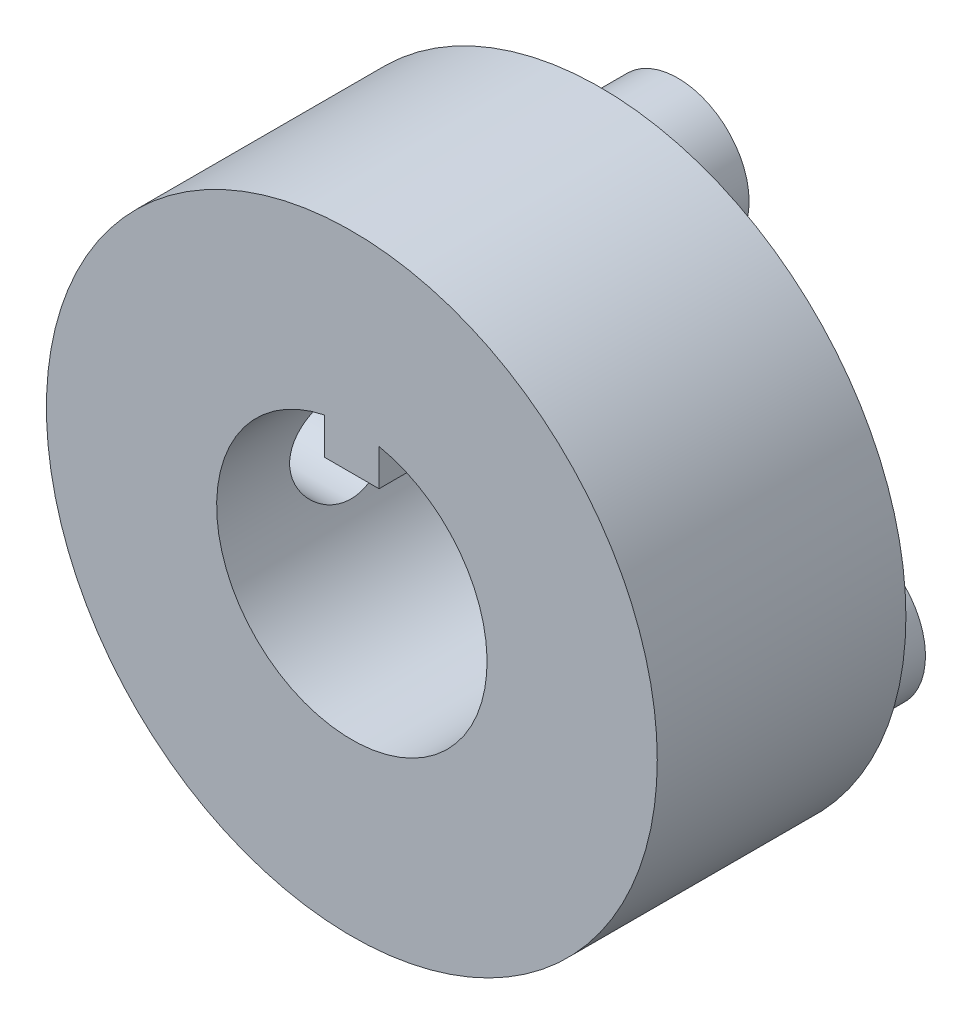
ISO-10303-21;
HEADER;
FILE_DESCRIPTION(('STEP AP214'),'2;1');
FILE_NAME('part.step','',(''),(''),'','','');
FILE_SCHEMA(('AUTOMOTIVE_DESIGN { 1 0 10303 214 1 1 1 1 }'));
ENDSEC;
DATA;
#1=APPLICATION_CONTEXT('core data for automotive mechanical design processes');
#2=APPLICATION_PROTOCOL_DEFINITION('international standard','automotive_design',2000,#1);
#3=PRODUCT_CONTEXT('',#1,'mechanical');
#4=PRODUCT('Part','Part','',(#3));
#5=PRODUCT_RELATED_PRODUCT_CATEGORY('part','',(#4));
#6=PRODUCT_DEFINITION_FORMATION('','',#4);
#7=PRODUCT_DEFINITION_CONTEXT('part definition',#1,'design');
#8=PRODUCT_DEFINITION('design','',#6,#7);
#9=PRODUCT_DEFINITION_SHAPE('','',#8);
#10=(LENGTH_UNIT() NAMED_UNIT(*) SI_UNIT(.MILLI.,.METRE.));
#11=(NAMED_UNIT(*) PLANE_ANGLE_UNIT() SI_UNIT($,.RADIAN.));
#12=(NAMED_UNIT(*) SI_UNIT($,.STERADIAN.) SOLID_ANGLE_UNIT());
#13=UNCERTAINTY_MEASURE_WITH_UNIT(LENGTH_MEASURE(1.E-05),#10,'distance_accuracy_value','');
#14=(GEOMETRIC_REPRESENTATION_CONTEXT(3) GLOBAL_UNCERTAINTY_ASSIGNED_CONTEXT((#13)) GLOBAL_UNIT_ASSIGNED_CONTEXT((#10,
#11,#12)) REPRESENTATION_CONTEXT('',''));
#15=CARTESIAN_POINT('',(0.,0.,0.));
#16=DIRECTION('',(0.,0.,1.));
#17=DIRECTION('',(1.,0.,0.));
#18=AXIS2_PLACEMENT_3D('',#15,#16,#17);
#19=CARTESIAN_POINT('',(0.,0.,0.));
#20=DIRECTION('',(0.,0.,1.));
#21=DIRECTION('',(1.,0.,0.));
#22=AXIS2_PLACEMENT_3D('',#19,#20,#21);
#23=PLANE('',#22);
#24=CARTESIAN_POINT('',(0.,0.,0.));
#25=DIRECTION('',(0.,0.,1.));
#26=DIRECTION('',(1.,0.,0.));
#27=AXIS2_PLACEMENT_3D('',#24,#25,#26);
#28=CIRCLE('',#27,15.);
#29=CARTESIAN_POINT('',(15.,0.,0.));
#30=VERTEX_POINT('',#29);
#31=EDGE_CURVE('E169',#30,#30,#28,.T.);
#32=ORIENTED_EDGE('',*,*,#31,.F.);
#33=EDGE_LOOP('',(#32));
#34=FACE_BOUND('',#33,.T.);
#35=CARTESIAN_POINT('',(0.,10.,0.));
#36=DIRECTION('',(0.,0.,1.));
#37=DIRECTION('',(1.,0.,0.));
#38=AXIS2_PLACEMENT_3D('',#35,#36,#37);
#39=CIRCLE('',#38,3.5);
#40=CARTESIAN_POINT('',(3.5,10.,0.));
#41=VERTEX_POINT('',#40);
#42=EDGE_CURVE('E11',#41,#41,#39,.F.);
#43=ORIENTED_EDGE('',*,*,#42,.F.);
#44=EDGE_LOOP('',(#43));
#45=FACE_BOUND('',#44,.T.);
#46=CARTESIAN_POINT('',(8.66025403784439,-5.,0.));
#47=DIRECTION('',(0.,0.,-1.));
#48=DIRECTION('',(-1.,0.,0.));
#49=AXIS2_PLACEMENT_3D('',#46,#47,#48);
#50=CIRCLE('',#49,3.5);
#51=CARTESIAN_POINT('',(6.10738194841974,-2.605664164108,0.));
#52=VERTEX_POINT('',#51);
#53=CARTESIAN_POINT('',(5.31026233405814,-3.986315835892,0.));
#54=VERTEX_POINT('',#53);
#55=EDGE_CURVE('E121',#52,#54,#50,.T.);
#56=ORIENTED_EDGE('',*,*,#55,.F.);
#57=CARTESIAN_POINT('',(0.,0.,0.));
#58=DIRECTION('',(0.,0.,1.));
#59=DIRECTION('',(1.,0.,0.));
#60=AXIS2_PLACEMENT_3D('',#57,#58,#59);
#61=CIRCLE('',#60,6.64);
#62=CARTESIAN_POINT('',(1.335,6.50441196419784,0.));
#63=VERTEX_POINT('',#62);
#64=EDGE_CURVE('E125',#52,#63,#61,.T.);
#65=ORIENTED_EDGE('',*,*,#64,.T.);
#66=DIRECTION('',(0.,-1.,0.));
#67=VECTOR('',#66,1.);
#68=CARTESIAN_POINT('',(1.335,6.50441196419784,0.));
#69=LINE('',#68,#67);
#70=CARTESIAN_POINT('',(1.335,4.70441196419784,0.));
#71=VERTEX_POINT('',#70);
#72=EDGE_CURVE('E148',#63,#71,#69,.T.);
#73=ORIENTED_EDGE('',*,*,#72,.T.);
#74=DIRECTION('',(-1.,0.,0.));
#75=VECTOR('',#74,1.);
#76=CARTESIAN_POINT('',(-1.335,4.70441196419784,0.));
#77=LINE('',#76,#75);
#78=CARTESIAN_POINT('',(-1.335,4.70441196419784,0.));
#79=VERTEX_POINT('',#78);
#80=EDGE_CURVE('E151',#71,#79,#77,.T.);
#81=ORIENTED_EDGE('',*,*,#80,.T.);
#82=DIRECTION('',(0.,1.,0.));
#83=VECTOR('',#82,1.);
#84=CARTESIAN_POINT('',(-1.335,6.50441196419784,0.));
#85=LINE('',#84,#83);
#86=CARTESIAN_POINT('',(-1.335,6.50441196419784,0.));
#87=VERTEX_POINT('',#86);
#88=EDGE_CURVE('E154',#79,#87,#85,.T.);
#89=ORIENTED_EDGE('',*,*,#88,.T.);
#90=CARTESIAN_POINT('',(-6.10738194841975,-2.605664164108,0.));
#91=VERTEX_POINT('',#90);
#92=EDGE_CURVE('E63',#87,#91,#61,.T.);
#93=ORIENTED_EDGE('',*,*,#92,.T.);
#94=CARTESIAN_POINT('',(-8.66025403784439,-5.,0.));
#95=DIRECTION('',(0.,0.,-1.));
#96=DIRECTION('',(-1.,0.,0.));
#97=AXIS2_PLACEMENT_3D('',#94,#95,#96);
#98=CIRCLE('',#97,3.5);
#99=CARTESIAN_POINT('',(-5.31026233405814,-3.986315835892,0.));
#100=VERTEX_POINT('',#99);
#101=EDGE_CURVE('E126',#100,#91,#98,.T.);
#102=ORIENTED_EDGE('',*,*,#101,.F.);
#103=EDGE_CURVE('E57',#100,#54,#61,.T.);
#104=ORIENTED_EDGE('',*,*,#103,.T.);
#105=EDGE_LOOP('',(#56,#65,#73,#81,#89,#93,#102,#104));
#106=FACE_BOUND('',#105,.T.);
#107=ADVANCED_FACE('F36',(#34,#45,#106),#23,.F.);
#108=CARTESIAN_POINT('',(0.,0.,12.21));
#109=DIRECTION('',(0.,0.,-1.));
#110=DIRECTION('',(-1.,0.,0.));
#111=AXIS2_PLACEMENT_3D('',#108,#109,#110);
#112=CYLINDRICAL_SURFACE('',#111,15.);
#113=CARTESIAN_POINT('',(-15.,0.,3.585));
#114=CARTESIAN_POINT('',(-14.9999975820402,0.140489449129902,3.58500561833362));
#115=CARTESIAN_POINT('',(-14.9980057235411,0.281055158639661,3.596788071638));
#116=CARTESIAN_POINT('',(-14.9902516226793,0.55824301697478,3.64358632645689));
#117=CARTESIAN_POINT('',(-14.9844859305538,0.694861438051567,3.67862338604372));
#118=CARTESIAN_POINT('',(-14.9698307561421,0.960104373013094,3.77084217064007));
#119=CARTESIAN_POINT('',(-14.9609438459442,1.08873536666226,3.82800566596403));
#120=CARTESIAN_POINT('',(-14.9410229706585,1.33456413906579,3.96280668191572));
#121=CARTESIAN_POINT('',(-14.9299892467727,1.45176320001943,4.04044190282042));
#122=CARTESIAN_POINT('',(-14.9068778267654,1.67255504412655,4.21478415064567));
#123=CARTESIAN_POINT('',(-14.8947918928735,1.77602075895102,4.3116510254663));
#124=CARTESIAN_POINT('',(-14.8710011481769,1.9653111769521,4.52136284107237));
#125=CARTESIAN_POINT('',(-14.8592963616635,2.05113475760514,4.63420879779461));
#126=CARTESIAN_POINT('',(-14.8375133644812,2.20321508602821,4.87354988110309));
#127=CARTESIAN_POINT('',(-14.8274457964338,2.26934596387795,5.00012604019429));
#128=CARTESIAN_POINT('',(-14.8101915074548,2.37935870184779,5.26278769275052));
#129=CARTESIAN_POINT('',(-14.8030045887206,2.42324208966741,5.3988725325393));
#130=CARTESIAN_POINT('',(-14.7924073748742,2.48711335537512,5.67534087574296));
#131=CARTESIAN_POINT('',(-14.7889624089038,2.50732074212323,5.81567231283677));
#132=CARTESIAN_POINT('',(-14.7861342891879,2.52394702595431,6.09777306098804));
#133=CARTESIAN_POINT('',(-14.7867508433751,2.5203676335643,6.23954226792224));
#134=CARTESIAN_POINT('',(-14.7919444520337,2.48970071316855,6.51892586463157));
#135=CARTESIAN_POINT('',(-14.7964799308277,2.46285995493418,6.656568226893));
#136=CARTESIAN_POINT('',(-14.8089352598191,2.38681956251066,6.92536784239926));
#137=CARTESIAN_POINT('',(-14.8168552277908,2.33761915024175,7.05652486978881));
#138=CARTESIAN_POINT('',(-14.8352319767055,2.21800641835068,7.30936848449366));
#139=CARTESIAN_POINT('',(-14.8457009436212,2.14749179899531,7.43100575477524));
#140=CARTESIAN_POINT('',(-14.8679876648032,1.98732491894457,7.66081497344489));
#141=CARTESIAN_POINT('',(-14.8798055296028,1.89767108939388,7.76898581682844));
#142=CARTESIAN_POINT('',(-14.9036410584866,1.70042706131254,7.97021986696351));
#143=CARTESIAN_POINT('',(-14.9156593643327,1.59262517722916,8.06307563444123));
#144=CARTESIAN_POINT('',(-14.9384040736532,1.36286061150674,8.22941181227365));
#145=CARTESIAN_POINT('',(-14.9491304685534,1.24089783589427,8.30289209403963));
#146=CARTESIAN_POINT('',(-14.9680983814198,0.986077223711798,8.42841104718477));
#147=CARTESIAN_POINT('',(-14.9763377512155,0.85321009375028,8.48043119649113));
#148=CARTESIAN_POINT('',(-14.9893860509763,0.580455493804954,8.56135967064502));
#149=CARTESIAN_POINT('',(-14.994195272579,0.440568621735489,8.5902699603614));
#150=CARTESIAN_POINT('',(-14.9998021394395,0.15953314780428,8.62387639269173));
#151=CARTESIAN_POINT('',(-15.0006469547058,0.018419503485328,8.62885727354189));
#152=CARTESIAN_POINT('',(-14.9983590828652,-0.262625887269974,8.61522290482472));
#153=CARTESIAN_POINT('',(-14.9952265513444,-0.402557679722594,8.59660857825747));
#154=CARTESIAN_POINT('',(-14.9853651785459,-0.676386280922814,8.5365490105393));
#155=CARTESIAN_POINT('',(-14.9786585798325,-0.810314920295131,8.49524492656208));
#156=CARTESIAN_POINT('',(-14.962398055966,-1.06934662832967,8.39112893177709));
#157=CARTESIAN_POINT('',(-14.9528439687972,-1.19444919430735,8.32831579712296));
#158=CARTESIAN_POINT('',(-14.9318313003863,-1.43351304524778,8.18231392836192));
#159=CARTESIAN_POINT('',(-14.9203564123948,-1.54736438754156,8.09894756611516));
#160=CARTESIAN_POINT('',(-14.8968237295547,-1.75956294657828,7.91444981087016));
#161=CARTESIAN_POINT('',(-14.8847658916907,-1.85790901690958,7.8133171054514));
#162=CARTESIAN_POINT('',(-14.8612735379745,-2.03736242488147,7.59487965788286));
#163=CARTESIAN_POINT('',(-14.8498469260686,-2.11827725953654,7.47741578374905));
#164=CARTESIAN_POINT('',(-14.8290590893405,-2.25922633810644,7.23039570889064));
#165=CARTESIAN_POINT('',(-14.8196977982932,-2.3192612515785,7.1008398960877));
#166=CARTESIAN_POINT('',(-14.8041599960693,-2.41645931453349,6.83384879847331));
#167=CARTESIAN_POINT('',(-14.7979702247869,-2.45371782043871,6.69644903478755));
#168=CARTESIAN_POINT('',(-14.7894432008793,-2.50460516510729,6.41722854692862));
#169=CARTESIAN_POINT('',(-14.7871056074096,-2.51823609446696,6.27540821502311));
#170=CARTESIAN_POINT('',(-14.7865624597904,-2.52142233821621,5.99329497799041));
#171=CARTESIAN_POINT('',(-14.7883048943293,-2.5112806984035,5.85300550369673));
#172=CARTESIAN_POINT('',(-14.795611402961,-2.46786546894644,5.57615940220628));
#173=CARTESIAN_POINT('',(-14.8011754640901,-2.43459195776879,5.43960276234882));
#174=CARTESIAN_POINT('',(-14.8154783999656,-2.34597432026304,5.17421865001475));
#175=CARTESIAN_POINT('',(-14.824213461393,-2.29065669553287,5.04538210955565));
#176=CARTESIAN_POINT('',(-14.8438778074605,-2.15955234300938,4.79876930831019));
#177=CARTESIAN_POINT('',(-14.8548072037857,-2.0837645732788,4.68099361093583));
#178=CARTESIAN_POINT('',(-14.877793434422,-1.91279142634958,4.45831542937924));
#179=CARTESIAN_POINT('',(-14.8898622707228,-1.81738324467583,4.35358522943975));
#180=CARTESIAN_POINT('',(-14.9136721670648,-1.61034705470809,4.16151761434907));
#181=CARTESIAN_POINT('',(-14.925413150854,-1.49871530997979,4.0741842168541));
#182=CARTESIAN_POINT('',(-14.9473401498941,-1.26146779080068,3.91882748561642));
#183=CARTESIAN_POINT('',(-14.9575146564198,-1.13575924688084,3.85094418244926));
#184=CARTESIAN_POINT('',(-14.9750503001442,-0.874602726333489,3.7373629677436));
#185=CARTESIAN_POINT('',(-14.9824142281429,-0.739164570513421,3.69164303654751));
#186=CARTESIAN_POINT('',(-14.9918983993726,-0.5026729914656,3.63357128054791));
#187=CARTESIAN_POINT('',(-14.9949202053315,-0.403047469656695,3.61538633869243));
#188=CARTESIAN_POINT('',(-14.9989718586461,-0.202294462457671,3.59109878222106));
#189=CARTESIAN_POINT('',(-15.0000017411823,-0.101167003625921,3.58499595421592));
#190=CARTESIAN_POINT('',(-15.,0.,3.585));
#191=B_SPLINE_CURVE_WITH_KNOTS('',3,(#113,#114,#115,#116,#117,#118,#119,#120,#121,#122,#123,
#124,#125,#126,#127,#128,#129,#130,#131,#132,#133,#134,#135,#136,#137,#138,#139,#140,#141,#142,
#143,#144,#145,#146,#147,#148,#149,#150,#151,#152,#153,#154,#155,#156,#157,#158,#159,#160,#161,
#162,#163,#164,#165,#166,#167,#168,#169,#170,#171,#172,#173,#174,#175,#176,#177,#178,#179,#180,
#181,#182,#183,#184,#185,#186,#187,#188,#189,#190),.UNSPECIFIED.,.T.,.F.,(4,2,2,2,2,2,2,2,2,2,2,
2,2,2,2,2,2,2,2,2,2,2,2,2,2,2,2,2,2,2,2,2,2,2,2,2,2,2,4),(0.,0.421098541802472,
0.842582559724108,1.26372005899792,1.68481026927768,2.10955919785378,2.53433514375074,
2.96177056420231,3.38917662937104,3.81258788817943,4.2359686994623,4.65491227546914,
5.07387043115051,5.4948722398034,5.91590857154812,6.34224783261434,6.76858992308264,
7.19529922008233,7.62197223313093,8.0435554340658,8.46512214396861,8.88409543234839,
9.30309256390771,9.72584620629777,10.1486310911353,10.5758695303914,11.0030942681128,
11.4285178995912,11.8539038871548,12.2738967222969,12.6938881327688,13.1133761423611,
13.5328855080593,13.9574515822421,14.3821155932715,14.8097642630611,15.236987181953,
15.5402272501239,15.8434619625472),.UNSPECIFIED.);
#192=CARTESIAN_POINT('',(-15.,0.,3.585));
#193=VERTEX_POINT('',#192);
#194=EDGE_CURVE('E185',#193,#193,#191,.T.);
#195=ORIENTED_EDGE('',*,*,#194,.T.);
#196=EDGE_LOOP('',(#195));
#197=FACE_BOUND('',#196,.T.);
#198=CARTESIAN_POINT('',(0.,0.,12.21));
#199=DIRECTION('',(0.,0.,1.));
#200=DIRECTION('',(1.,0.,0.));
#201=AXIS2_PLACEMENT_3D('',#198,#199,#200);
#202=CIRCLE('',#201,15.);
#203=CARTESIAN_POINT('',(15.,0.,12.21));
#204=VERTEX_POINT('',#203);
#205=EDGE_CURVE('E50',#204,#204,#202,.T.);
#206=ORIENTED_EDGE('',*,*,#205,.F.);
#207=EDGE_LOOP('',(#206));
#208=FACE_BOUND('',#207,.T.);
#209=ORIENTED_EDGE('',*,*,#31,.T.);
#210=EDGE_LOOP('',(#209));
#211=FACE_BOUND('',#210,.T.);
#212=ADVANCED_FACE('F38',(#197,#208,#211),#112,.T.);
#213=CARTESIAN_POINT('',(0.,0.,12.21));
#214=DIRECTION('',(0.,0.,1.));
#215=DIRECTION('',(1.,0.,0.));
#216=AXIS2_PLACEMENT_3D('',#213,#214,#215);
#217=PLANE('',#216);
#218=CARTESIAN_POINT('',(0.,0.,12.21));
#219=DIRECTION('',(0.,0.,1.));
#220=DIRECTION('',(1.,0.,0.));
#221=AXIS2_PLACEMENT_3D('',#218,#219,#220);
#222=CIRCLE('',#221,6.64);
#223=CARTESIAN_POINT('',(-1.335,6.50441196419784,12.21));
#224=VERTEX_POINT('',#223);
#225=CARTESIAN_POINT('',(1.335,6.50441196419784,12.21));
#226=VERTEX_POINT('',#225);
#227=EDGE_CURVE('E146',#224,#226,#222,.T.);
#228=ORIENTED_EDGE('',*,*,#227,.F.);
#229=DIRECTION('',(0.,1.,0.));
#230=VECTOR('',#229,1.);
#231=CARTESIAN_POINT('',(-1.335,6.50441196419784,12.21));
#232=LINE('',#231,#230);
#233=CARTESIAN_POINT('',(-1.335,4.70441196419784,12.21));
#234=VERTEX_POINT('',#233);
#235=EDGE_CURVE('E164',#234,#224,#232,.T.);
#236=ORIENTED_EDGE('',*,*,#235,.F.);
#237=DIRECTION('',(-1.,0.,0.));
#238=VECTOR('',#237,1.);
#239=CARTESIAN_POINT('',(-1.335,4.70441196419784,12.21));
#240=LINE('',#239,#238);
#241=CARTESIAN_POINT('',(1.335,4.70441196419784,12.21));
#242=VERTEX_POINT('',#241);
#243=EDGE_CURVE('E161',#242,#234,#240,.T.);
#244=ORIENTED_EDGE('',*,*,#243,.F.);
#245=DIRECTION('',(0.,-1.,0.));
#246=VECTOR('',#245,1.);
#247=CARTESIAN_POINT('',(1.335,6.50441196419784,12.21));
#248=LINE('',#247,#246);
#249=EDGE_CURVE('E158',#226,#242,#248,.T.);
#250=ORIENTED_EDGE('',*,*,#249,.F.);
#251=EDGE_LOOP('',(#228,#236,#244,#250));
#252=FACE_BOUND('',#251,.T.);
#253=ORIENTED_EDGE('',*,*,#205,.T.);
#254=EDGE_LOOP('',(#253));
#255=FACE_BOUND('',#254,.T.);
#256=ADVANCED_FACE('F230',(#252,#255),#217,.T.);
#257=CARTESIAN_POINT('',(0.,0.,0.));
#258=DIRECTION('',(0.,0.,1.));
#259=DIRECTION('',(1.,0.,0.));
#260=AXIS2_PLACEMENT_3D('',#257,#258,#259);
#261=CYLINDRICAL_SURFACE('',#260,6.64);
#262=CARTESIAN_POINT('',(-6.64,0.,3.585));
#263=CARTESIAN_POINT('',(-6.64000411584716,-0.136357755125959,3.58499455309879));
#264=CARTESIAN_POINT('',(-6.63576339590568,-0.272678678757785,3.59610191612086));
#265=CARTESIAN_POINT('',(-6.61927097472318,-0.541240136044643,3.64005287463028));
#266=CARTESIAN_POINT('',(-6.60702063952025,-0.673481361464684,3.67289276365175));
#267=CARTESIAN_POINT('',(-6.57582201798928,-0.929970988338998,3.75897574133022));
#268=CARTESIAN_POINT('',(-6.55688684891109,-1.05423448366339,3.81217888946313));
#269=CARTESIAN_POINT('',(-6.51419935477894,-1.29206163337442,3.93727242931435));
#270=CARTESIAN_POINT('',(-6.49044570570496,-1.40562233426289,4.00916795885055));
#271=CARTESIAN_POINT('',(-6.43941764179323,-1.62374277556832,4.17285805764356));
#272=CARTESIAN_POINT('',(-6.41204192939597,-1.72777749824901,4.26532033940538));
#273=CARTESIAN_POINT('',(-6.3573473984877,-1.91928929666345,4.46610181919315));
#274=CARTESIAN_POINT('',(-6.33002860071342,-2.00676112427345,4.57442602401666));
#275=CARTESIAN_POINT('',(-6.27735470880237,-2.16604341852793,4.80903347240452));
#276=CARTESIAN_POINT('',(-6.25211861491086,-2.23710530629482,4.9358543561982));
#277=CARTESIAN_POINT('',(-6.208047818367,-2.35665703538024,5.20075528840581));
#278=CARTESIAN_POINT('',(-6.18921048911562,-2.40515614141839,5.33883068807601));
#279=CARTESIAN_POINT('',(-6.16115511869846,-2.47612142324354,5.61627207613328));
#280=CARTESIAN_POINT('',(-6.15156780814298,-2.49959129953904,5.75534271310348));
#281=CARTESIAN_POINT('',(-6.14201915060118,-2.52296976767562,6.03575354874365));
#282=CARTESIAN_POINT('',(-6.1420537034227,-2.52288839547701,6.17709275502662));
#283=CARTESIAN_POINT('',(-6.15142708614572,-2.49993291210435,6.4487662556688));
#284=CARTESIAN_POINT('',(-6.16019324036794,-2.47846167531625,6.57924254420817));
#285=CARTESIAN_POINT('',(-6.18508869858688,-2.41565866348566,6.8345789173816));
#286=CARTESIAN_POINT('',(-6.20121913907468,-2.37432382294721,6.95943813189417));
#287=CARTESIAN_POINT('',(-6.23936360330196,-2.27221267259243,7.20281830054505));
#288=CARTESIAN_POINT('',(-6.26148465893778,-2.21107827871382,7.32117150359388));
#289=CARTESIAN_POINT('',(-6.30908334057454,-2.07135329252578,7.5463423433537));
#290=CARTESIAN_POINT('',(-6.33456214374711,-1.99275657154979,7.65315591044605));
#291=CARTESIAN_POINT('',(-6.3881485418272,-1.81395712419897,7.85996581401401));
#292=CARTESIAN_POINT('',(-6.41631624588967,-1.7126381115178,7.95898388126023));
#293=CARTESIAN_POINT('',(-6.47059893522083,-1.49451282205522,8.13891823811803));
#294=CARTESIAN_POINT('',(-6.49671358908775,-1.37770405307202,8.21983160915926));
#295=CARTESIAN_POINT('',(-6.5444895777279,-1.12937060086937,8.36237396409063));
#296=CARTESIAN_POINT('',(-6.56607201364147,-0.99763837824563,8.42366971292678));
#297=CARTESIAN_POINT('',(-6.60176464335614,-0.724708223765741,8.52290312021829));
#298=CARTESIAN_POINT('',(-6.61587823937631,-0.583514634847382,8.56085141523002));
#299=CARTESIAN_POINT('',(-6.6344410176147,-0.303897173988625,8.61041479701922));
#300=CARTESIAN_POINT('',(-6.63937294691418,-0.1657385707628,8.62334674835339));
#301=CARTESIAN_POINT('',(-6.64051360870022,0.110847069909799,8.6263543268913));
#302=CARTESIAN_POINT('',(-6.63672433126645,0.249274038916533,8.61643516845655));
#303=CARTESIAN_POINT('',(-6.62116648244824,0.516727416107683,8.57501747992149));
#304=CARTESIAN_POINT('',(-6.60971944590668,0.64590908368897,8.5443880013157));
#305=CARTESIAN_POINT('',(-6.58032233648794,0.897203933514361,8.46357012877743));
#306=CARTESIAN_POINT('',(-6.56237141870938,1.01931619499985,8.41337919360557));
#307=CARTESIAN_POINT('',(-6.52107241090368,1.2570648462155,8.29325340695158));
#308=CARTESIAN_POINT('',(-6.49758011694014,1.37240200502256,8.22277743163937));
#309=CARTESIAN_POINT('',(-6.44778794209088,1.59000340814238,8.06469165816309));
#310=CARTESIAN_POINT('',(-6.42148700899178,1.69226272129032,7.97707542836813));
#311=CARTESIAN_POINT('',(-6.3670279462564,1.88716743385005,7.78107096626575));
#312=CARTESIAN_POINT('',(-6.33885235498527,1.97887998654975,7.67175755574685));
#313=CARTESIAN_POINT('',(-6.28531998306322,2.14285178362287,7.43874709251645));
#314=CARTESIAN_POINT('',(-6.2599634894158,2.21510904837709,7.31504857792063));
#315=CARTESIAN_POINT('',(-6.21502296420474,2.33825381082786,7.0556196221519));
#316=CARTESIAN_POINT('',(-6.19546866879011,2.38903177368382,6.9198316842764));
#317=CARTESIAN_POINT('',(-6.16497961929026,2.46665747434898,6.64068005709035));
#318=CARTESIAN_POINT('',(-6.1540393556616,2.49352050960925,6.49732127282301));
#319=CARTESIAN_POINT('',(-6.14276050841498,2.52116941085043,6.21723291784191));
#320=CARTESIAN_POINT('',(-6.14177327515158,2.52355097587737,6.08068573987947));
#321=CARTESIAN_POINT('',(-6.14884284632876,2.50627559714512,5.80924450782834));
#322=CARTESIAN_POINT('',(-6.15689874920244,2.48662085032417,5.67435029030097));
#323=CARTESIAN_POINT('',(-6.18060111833175,2.42708444393661,5.41443692634685));
#324=CARTESIAN_POINT('',(-6.19599623786512,2.38787070066587,5.28923987885087));
#325=CARTESIAN_POINT('',(-6.23249038306663,2.29092404943623,5.04713270571102));
#326=CARTESIAN_POINT('',(-6.25359086667582,2.23318640720069,4.93022470789144));
#327=CARTESIAN_POINT('',(-6.30051769970694,2.09726049430068,4.70123354350461));
#328=CARTESIAN_POINT('',(-6.32653605721063,2.01814586433716,4.58974010723772));
#329=CARTESIAN_POINT('',(-6.37971982097827,1.84313132761669,4.38110283352405));
#330=CARTESIAN_POINT('',(-6.40688559412407,1.74722602080069,4.28396363114072));
#331=CARTESIAN_POINT('',(-6.46112967807416,1.53494030612353,4.10124344163899));
#332=CARTESIAN_POINT('',(-6.48811800679083,1.41771438668388,4.01661357117311));
#333=CARTESIAN_POINT('',(-6.53737272425688,1.16975372184909,3.86827269769814));
#334=CARTESIAN_POINT('',(-6.55963854879912,1.03901736510648,3.80456419370908));
#335=CARTESIAN_POINT('',(-6.59790672777533,0.760274579473578,3.69754808508467));
#336=CARTESIAN_POINT('',(-6.61350980930843,0.611718232627888,3.6555156850542));
#337=CARTESIAN_POINT('',(-6.63455140265937,0.30875674711432,3.59925214648717));
#338=CARTESIAN_POINT('',(-6.63999534092751,0.154354775850469,3.58500616580418));
#339=CARTESIAN_POINT('',(-6.64,0.,3.585));
#340=B_SPLINE_CURVE_WITH_KNOTS('',3,(#262,#263,#264,#265,#266,#267,#268,#269,#270,#271,#272,
#273,#274,#275,#276,#277,#278,#279,#280,#281,#282,#283,#284,#285,#286,#287,#288,#289,#290,#291,
#292,#293,#294,#295,#296,#297,#298,#299,#300,#301,#302,#303,#304,#305,#306,#307,#308,#309,#310,
#311,#312,#313,#314,#315,#316,#317,#318,#319,#320,#321,#322,#323,#324,#325,#326,#327,#328,#329,
#330,#331,#332,#333,#334,#335,#336,#337,#338,#339),.UNSPECIFIED.,.T.,.F.,(4,2,2,2,2,2,2,2,2,2,2,
2,2,2,2,2,2,2,2,2,2,2,2,2,2,2,2,2,2,2,2,2,2,2,2,2,2,2,4),(0.,0.408503799274263,
0.816937946483518,1.22457506202419,1.63232434002508,2.05600446869884,2.47981862095114,
2.92025082002839,3.36050200905487,3.7823454180068,4.20400906589539,4.59972536249002,
4.99550274852648,5.39888006960272,5.80239918628821,6.23374878339285,6.66516786625901,
7.10356792372682,7.54176810815578,7.95619648064894,8.37053029470175,8.76847587668888,
9.16647317324264,9.57626730839355,9.98621550879624,10.420532949192,10.8548945656754,
11.2914452814524,11.7277165516192,12.1353560832413,12.5429549783333,12.9375006801632,
13.3321472991099,13.7478387178209,14.1636640736978,14.6027613414888,15.0419110396063,
15.5045779425159,15.9669976436381),.UNSPECIFIED.);
#341=CARTESIAN_POINT('',(-6.64,0.,3.585));
#342=VERTEX_POINT('',#341);
#343=EDGE_CURVE('E41',#342,#342,#340,.T.);
#344=ORIENTED_EDGE('',*,*,#343,.T.);
#345=EDGE_LOOP('',(#344));
#346=FACE_BOUND('',#345,.T.);
#347=ORIENTED_EDGE('',*,*,#227,.T.);
#348=DIRECTION('',(0.,0.,1.));
#349=VECTOR('',#348,1.);
#350=CARTESIAN_POINT('',(1.335,6.50441196419784,0.));
#351=LINE('',#350,#349);
#352=EDGE_CURVE('E156',#63,#226,#351,.T.);
#353=ORIENTED_EDGE('',*,*,#352,.F.);
#354=ORIENTED_EDGE('',*,*,#64,.F.);
#355=DIRECTION('',(0.,0.,1.));
#356=VECTOR('',#355,1.);
#357=CARTESIAN_POINT('',(6.10738194841974,-2.605664164108,-3.8));
#358=LINE('',#357,#356);
#359=CARTESIAN_POINT('',(6.10738194841974,-2.605664164108,-3.8));
#360=VERTEX_POINT('',#359);
#361=EDGE_CURVE('E112',#360,#52,#358,.T.);
#362=ORIENTED_EDGE('',*,*,#361,.F.);
#363=CARTESIAN_POINT('',(0.,0.,-3.8));
#364=DIRECTION('',(0.,0.,-1.));
#365=DIRECTION('',(-1.,0.,0.));
#366=AXIS2_PLACEMENT_3D('',#363,#364,#365);
#367=CIRCLE('',#366,6.64);
#368=CARTESIAN_POINT('',(5.31026233405814,-3.986315835892,-3.8));
#369=VERTEX_POINT('',#368);
#370=EDGE_CURVE('E117',#369,#360,#367,.F.);
#371=ORIENTED_EDGE('',*,*,#370,.F.);
#372=DIRECTION('',(0.,0.,1.));
#373=VECTOR('',#372,1.);
#374=CARTESIAN_POINT('',(5.31026233405814,-3.986315835892,-3.8));
#375=LINE('',#374,#373);
#376=EDGE_CURVE('E114',#369,#54,#375,.T.);
#377=ORIENTED_EDGE('',*,*,#376,.T.);
#378=ORIENTED_EDGE('',*,*,#103,.F.);
#379=DIRECTION('',(0.,0.,1.));
#380=VECTOR('',#379,1.);
#381=CARTESIAN_POINT('',(-5.31026233405814,-3.986315835892,-3.8));
#382=LINE('',#381,#380);
#383=CARTESIAN_POINT('',(-5.31026233405814,-3.986315835892,-3.8));
#384=VERTEX_POINT('',#383);
#385=EDGE_CURVE('E140',#384,#100,#382,.T.);
#386=ORIENTED_EDGE('',*,*,#385,.F.);
#387=CARTESIAN_POINT('',(0.,0.,-3.8));
#388=DIRECTION('',(0.,0.,-1.));
#389=DIRECTION('',(-1.,0.,0.));
#390=AXIS2_PLACEMENT_3D('',#387,#388,#389);
#391=CIRCLE('',#390,6.64);
#392=CARTESIAN_POINT('',(-6.10738194841974,-2.605664164108,-3.8));
#393=VERTEX_POINT('',#392);
#394=EDGE_CURVE('E128',#393,#384,#391,.F.);
#395=ORIENTED_EDGE('',*,*,#394,.F.);
#396=DIRECTION('',(0.,0.,1.));
#397=VECTOR('',#396,1.);
#398=CARTESIAN_POINT('',(-6.10738194841974,-2.605664164108,-3.8));
#399=LINE('',#398,#397);
#400=EDGE_CURVE('E136',#393,#91,#399,.T.);
#401=ORIENTED_EDGE('',*,*,#400,.T.);
#402=ORIENTED_EDGE('',*,*,#92,.F.);
#403=DIRECTION('',(0.,0.,1.));
#404=VECTOR('',#403,1.);
#405=CARTESIAN_POINT('',(-1.335,6.50441196419784,0.));
#406=LINE('',#405,#404);
#407=EDGE_CURVE('E167',#87,#224,#406,.T.);
#408=ORIENTED_EDGE('',*,*,#407,.T.);
#409=EDGE_LOOP('',(#347,#353,#354,#362,#371,#377,#378,#386,#395,#401,#402,#408));
#410=FACE_BOUND('',#409,.T.);
#411=ADVANCED_FACE('F123',(#346,#410),#261,.F.);
#412=CARTESIAN_POINT('',(-1.335,6.50441196419784,0.));
#413=DIRECTION('',(1.,0.,0.));
#414=DIRECTION('',(0.,1.,0.));
#415=AXIS2_PLACEMENT_3D('',#412,#413,#414);
#416=PLANE('',#415);
#417=ORIENTED_EDGE('',*,*,#235,.T.);
#418=ORIENTED_EDGE('',*,*,#407,.F.);
#419=ORIENTED_EDGE('',*,*,#88,.F.);
#420=DIRECTION('',(0.,0.,1.));
#421=VECTOR('',#420,1.);
#422=CARTESIAN_POINT('',(-1.335,4.70441196419784,0.));
#423=LINE('',#422,#421);
#424=EDGE_CURVE('E170',#79,#234,#423,.T.);
#425=ORIENTED_EDGE('',*,*,#424,.T.);
#426=EDGE_LOOP('',(#417,#418,#419,#425));
#427=FACE_BOUND('',#426,.T.);
#428=ADVANCED_FACE('F217',(#427),#416,.F.);
#429=CARTESIAN_POINT('',(-1.335,4.70441196419784,0.));
#430=DIRECTION('',(0.,1.,0.));
#431=DIRECTION('',(0.,0.,1.));
#432=AXIS2_PLACEMENT_3D('',#429,#430,#431);
#433=PLANE('',#432);
#434=ORIENTED_EDGE('',*,*,#243,.T.);
#435=ORIENTED_EDGE('',*,*,#424,.F.);
#436=ORIENTED_EDGE('',*,*,#80,.F.);
#437=DIRECTION('',(0.,0.,1.));
#438=VECTOR('',#437,1.);
#439=CARTESIAN_POINT('',(1.335,4.70441196419784,0.));
#440=LINE('',#439,#438);
#441=EDGE_CURVE('E172',#71,#242,#440,.T.);
#442=ORIENTED_EDGE('',*,*,#441,.T.);
#443=EDGE_LOOP('',(#434,#435,#436,#442));
#444=FACE_BOUND('',#443,.T.);
#445=ADVANCED_FACE('F220',(#444),#433,.F.);
#446=CARTESIAN_POINT('',(1.335,6.50441196419784,0.));
#447=DIRECTION('',(-1.,0.,0.));
#448=DIRECTION('',(0.,-1.,0.));
#449=AXIS2_PLACEMENT_3D('',#446,#447,#448);
#450=PLANE('',#449);
#451=ORIENTED_EDGE('',*,*,#249,.T.);
#452=ORIENTED_EDGE('',*,*,#441,.F.);
#453=ORIENTED_EDGE('',*,*,#72,.F.);
#454=ORIENTED_EDGE('',*,*,#352,.T.);
#455=EDGE_LOOP('',(#451,#452,#453,#454));
#456=FACE_BOUND('',#455,.T.);
#457=ADVANCED_FACE('F215',(#456),#450,.F.);
#458=CARTESIAN_POINT('',(0.,10.,-3.8));
#459=DIRECTION('',(0.,0.,1.));
#460=DIRECTION('',(1.,0.,0.));
#461=AXIS2_PLACEMENT_3D('',#458,#459,#460);
#462=CYLINDRICAL_SURFACE('',#461,3.5);
#463=CARTESIAN_POINT('',(0.,10.,-3.8));
#464=DIRECTION('',(0.,0.,-1.));
#465=DIRECTION('',(-1.,0.,0.));
#466=AXIS2_PLACEMENT_3D('',#463,#464,#465);
#467=CIRCLE('',#466,3.5);
#468=CARTESIAN_POINT('',(3.5,10.,-3.8));
#469=VERTEX_POINT('',#468);
#470=EDGE_CURVE('E143',#469,#469,#467,.T.);
#471=CARTESIAN_POINT('',(3.5,10.,-3.8));
#472=CARTESIAN_POINT('',(3.5,10.,-3.76041666666667));
#473=CARTESIAN_POINT('',(3.5,10.,-3.72083333333333));
#474=CARTESIAN_POINT('',(3.5,10.,-3.64166666666667));
#475=CARTESIAN_POINT('',(3.5,10.,-3.60208333333333));
#476=CARTESIAN_POINT('',(3.5,10.,-3.52291666666667));
#477=CARTESIAN_POINT('',(3.5,10.,-3.48333333333333));
#478=CARTESIAN_POINT('',(3.5,10.,-3.40416666666667));
#479=CARTESIAN_POINT('',(3.5,10.,-3.36458333333333));
#480=CARTESIAN_POINT('',(3.5,10.,-3.28541666666667));
#481=CARTESIAN_POINT('',(3.5,10.,-3.24583333333333));
#482=CARTESIAN_POINT('',(3.5,10.,-3.16666666666667));
#483=CARTESIAN_POINT('',(3.5,10.,-3.12708333333333));
#484=CARTESIAN_POINT('',(3.5,10.,-3.04791666666667));
#485=CARTESIAN_POINT('',(3.5,10.,-3.00833333333333));
#486=CARTESIAN_POINT('',(3.5,10.,-2.92916666666667));
#487=CARTESIAN_POINT('',(3.5,10.,-2.88958333333333));
#488=CARTESIAN_POINT('',(3.5,10.,-2.81041666666667));
#489=CARTESIAN_POINT('',(3.5,10.,-2.77083333333333));
#490=CARTESIAN_POINT('',(3.5,10.,-2.69166666666667));
#491=CARTESIAN_POINT('',(3.5,10.,-2.65208333333333));
#492=CARTESIAN_POINT('',(3.5,10.,-2.57291666666667));
#493=CARTESIAN_POINT('',(3.5,10.,-2.53333333333333));
#494=CARTESIAN_POINT('',(3.5,10.,-2.45416666666667));
#495=CARTESIAN_POINT('',(3.5,10.,-2.41458333333333));
#496=CARTESIAN_POINT('',(3.5,10.,-2.33541666666667));
#497=CARTESIAN_POINT('',(3.5,10.,-2.29583333333333));
#498=CARTESIAN_POINT('',(3.5,10.,-2.21666666666667));
#499=CARTESIAN_POINT('',(3.5,10.,-2.17708333333333));
#500=CARTESIAN_POINT('',(3.5,10.,-2.09791666666667));
#501=CARTESIAN_POINT('',(3.5,10.,-2.05833333333333));
#502=CARTESIAN_POINT('',(3.5,10.,-1.97916666666667));
#503=CARTESIAN_POINT('',(3.5,10.,-1.93958333333333));
#504=CARTESIAN_POINT('',(3.5,10.,-1.86041666666667));
#505=CARTESIAN_POINT('',(3.5,10.,-1.82083333333333));
#506=CARTESIAN_POINT('',(3.5,10.,-1.74166666666667));
#507=CARTESIAN_POINT('',(3.5,10.,-1.70208333333333));
#508=CARTESIAN_POINT('',(3.5,10.,-1.62291666666667));
#509=CARTESIAN_POINT('',(3.5,10.,-1.58333333333333));
#510=CARTESIAN_POINT('',(3.5,10.,-1.50416666666667));
#511=CARTESIAN_POINT('',(3.5,10.,-1.46458333333333));
#512=CARTESIAN_POINT('',(3.5,10.,-1.38541666666667));
#513=CARTESIAN_POINT('',(3.5,10.,-1.34583333333333));
#514=CARTESIAN_POINT('',(3.5,10.,-1.26666666666667));
#515=CARTESIAN_POINT('',(3.5,10.,-1.22708333333333));
#516=CARTESIAN_POINT('',(3.5,10.,-1.14791666666667));
#517=CARTESIAN_POINT('',(3.5,10.,-1.10833333333333));
#518=CARTESIAN_POINT('',(3.5,10.,-1.02916666666667));
#519=CARTESIAN_POINT('',(3.5,10.,-0.989583333333333));
#520=CARTESIAN_POINT('',(3.5,10.,-0.910416666666667));
#521=CARTESIAN_POINT('',(3.5,10.,-0.870833333333333));
#522=CARTESIAN_POINT('',(3.5,10.,-0.791666666666667));
#523=CARTESIAN_POINT('',(3.5,10.,-0.752083333333333));
#524=CARTESIAN_POINT('',(3.5,10.,-0.672916666666667));
#525=CARTESIAN_POINT('',(3.5,10.,-0.633333333333333));
#526=CARTESIAN_POINT('',(3.5,10.,-0.554166666666667));
#527=CARTESIAN_POINT('',(3.5,10.,-0.514583333333334));
#528=CARTESIAN_POINT('',(3.5,10.,-0.435416666666667));
#529=CARTESIAN_POINT('',(3.5,10.,-0.395833333333333));
#530=CARTESIAN_POINT('',(3.5,10.,-0.316666666666666));
#531=CARTESIAN_POINT('',(3.5,10.,-0.277083333333333));
#532=CARTESIAN_POINT('',(3.5,10.,-0.197916666666667));
#533=CARTESIAN_POINT('',(3.5,10.,-0.158333333333333));
#534=CARTESIAN_POINT('',(3.5,10.,-0.0791666666666666));
#535=CARTESIAN_POINT('',(3.5,10.,-0.0395833333333333));
#536=CARTESIAN_POINT('',(3.5,10.,0.));
#537=B_SPLINE_CURVE_WITH_KNOTS('',3,(#471,#472,#473,#474,#475,#476,#477,#478,#479,#480,#481,
#482,#483,#484,#485,#486,#487,#488,#489,#490,#491,#492,#493,#494,#495,#496,#497,#498,#499,#500,
#501,#502,#503,#504,#505,#506,#507,#508,#509,#510,#511,#512,#513,#514,#515,#516,#517,#518,#519,
#520,#521,#522,#523,#524,#525,#526,#527,#528,#529,#530,#531,#532,#533,#534,#535,#536),
.UNSPECIFIED.,.F.,.F.,(4,2,2,2,2,2,2,2,2,2,2,2,2,2,2,2,2,2,2,2,2,2,2,2,2,2,2,2,2,2,2,2,4),(0.,
0.11875,0.2375,0.35625,0.475,0.59375,0.7125,0.831249999999999,0.95,1.06875,1.1875,1.30625,1.425,
1.54375,1.6625,1.78125,1.9,2.01875,2.1375,2.25625,2.375,2.49375,2.6125,2.73125,2.85,2.96875,
3.0875,3.20625,3.325,3.44375,3.5625,3.68125,3.8),.UNSPECIFIED.);
#538=EDGE_CURVE('BSEAM211',#469,#41,#537,.T.);
#539=ORIENTED_EDGE('',*,*,#470,.F.);
#540=ORIENTED_EDGE('',*,*,#42,.T.);
#541=ORIENTED_EDGE('',*,*,#538,.T.);
#542=ORIENTED_EDGE('',*,*,#538,.F.);
#543=EDGE_LOOP('',(#539,#541,#540,#542));
#544=FACE_BOUND('',#543,.T.);
#545=ADVANCED_FACE('F211',(#544),#462,.T.);
#546=CARTESIAN_POINT('',(0.,0.,-3.8));
#547=DIRECTION('',(0.,0.,-1.));
#548=DIRECTION('',(-1.,0.,0.));
#549=AXIS2_PLACEMENT_3D('',#546,#547,#548);
#550=PLANE('',#549);
#551=ORIENTED_EDGE('',*,*,#470,.T.);
#552=EDGE_LOOP('',(#551));
#553=FACE_BOUND('',#552,.T.);
#554=ADVANCED_FACE('F207',(#553),#550,.T.);
#555=CARTESIAN_POINT('',(-8.66025403784439,-5.,-3.8));
#556=DIRECTION('',(0.,0.,1.));
#557=DIRECTION('',(1.,0.,0.));
#558=AXIS2_PLACEMENT_3D('',#555,#556,#557);
#559=CYLINDRICAL_SURFACE('',#558,3.5);
#560=ORIENTED_EDGE('',*,*,#101,.T.);
#561=ORIENTED_EDGE('',*,*,#400,.F.);
#562=CARTESIAN_POINT('',(-8.66025403784439,-5.,-3.8));
#563=DIRECTION('',(0.,0.,-1.));
#564=DIRECTION('',(-1.,0.,0.));
#565=AXIS2_PLACEMENT_3D('',#562,#563,#564);
#566=CIRCLE('',#565,3.5);
#567=EDGE_CURVE('E135',#384,#393,#566,.T.);
#568=ORIENTED_EDGE('',*,*,#567,.F.);
#569=ORIENTED_EDGE('',*,*,#385,.T.);
#570=EDGE_LOOP('',(#560,#561,#568,#569));
#571=FACE_BOUND('',#570,.T.);
#572=ADVANCED_FACE('F203',(#571),#559,.T.);
#573=CARTESIAN_POINT('',(0.,0.,-3.8));
#574=DIRECTION('',(0.,0.,-1.));
#575=DIRECTION('',(-1.,0.,0.));
#576=AXIS2_PLACEMENT_3D('',#573,#574,#575);
#577=PLANE('',#576);
#578=ORIENTED_EDGE('',*,*,#394,.T.);
#579=ORIENTED_EDGE('',*,*,#567,.T.);
#580=EDGE_LOOP('',(#578,#579));
#581=FACE_BOUND('',#580,.T.);
#582=ADVANCED_FACE('F200',(#581),#577,.T.);
#583=CARTESIAN_POINT('',(8.66025403784439,-5.,-3.8));
#584=DIRECTION('',(0.,0.,1.));
#585=DIRECTION('',(1.,0.,0.));
#586=AXIS2_PLACEMENT_3D('',#583,#584,#585);
#587=CYLINDRICAL_SURFACE('',#586,3.5);
#588=ORIENTED_EDGE('',*,*,#55,.T.);
#589=ORIENTED_EDGE('',*,*,#376,.F.);
#590=CARTESIAN_POINT('',(8.66025403784439,-5.,-3.8));
#591=DIRECTION('',(0.,0.,-1.));
#592=DIRECTION('',(-1.,0.,0.));
#593=AXIS2_PLACEMENT_3D('',#590,#591,#592);
#594=CIRCLE('',#593,3.5);
#595=EDGE_CURVE('E108',#360,#369,#594,.T.);
#596=ORIENTED_EDGE('',*,*,#595,.F.);
#597=ORIENTED_EDGE('',*,*,#361,.T.);
#598=EDGE_LOOP('',(#588,#589,#596,#597));
#599=FACE_BOUND('',#598,.T.);
#600=ADVANCED_FACE('F110',(#599),#587,.T.);
#601=CARTESIAN_POINT('',(0.,0.,-3.8));
#602=DIRECTION('',(0.,0.,-1.));
#603=DIRECTION('',(-1.,0.,0.));
#604=AXIS2_PLACEMENT_3D('',#601,#602,#603);
#605=PLANE('',#604);
#606=ORIENTED_EDGE('',*,*,#370,.T.);
#607=ORIENTED_EDGE('',*,*,#595,.T.);
#608=EDGE_LOOP('',(#606,#607));
#609=FACE_BOUND('',#608,.T.);
#610=ADVANCED_FACE('F119',(#609),#605,.T.);
#611=CARTESIAN_POINT('',(-15.,0.,6.105));
#612=DIRECTION('',(1.,0.,0.));
#613=DIRECTION('',(0.,0.,-1.));
#614=AXIS2_PLACEMENT_3D('',#611,#612,#613);
#615=CYLINDRICAL_SURFACE('',#614,2.52);
#616=ORIENTED_EDGE('',*,*,#343,.F.);
#617=EDGE_LOOP('',(#616));
#618=FACE_BOUND('',#617,.T.);
#619=ORIENTED_EDGE('',*,*,#194,.F.);
#620=EDGE_LOOP('',(#619));
#621=FACE_BOUND('',#620,.T.);
#622=ADVANCED_FACE('F190',(#618,#621),#615,.F.);
#623=CLOSED_SHELL('',(#107,#212,#256,#411,#428,#445,#457,#545,#554,#572,#582,#600,#610,#622));
#624=MANIFOLD_SOLID_BREP('B2',#623);
#625=ADVANCED_BREP_SHAPE_REPRESENTATION('',(#18,#624),#14);
#626=SHAPE_DEFINITION_REPRESENTATION(#9,#625);
ENDSEC;
END-ISO-10303-21;
